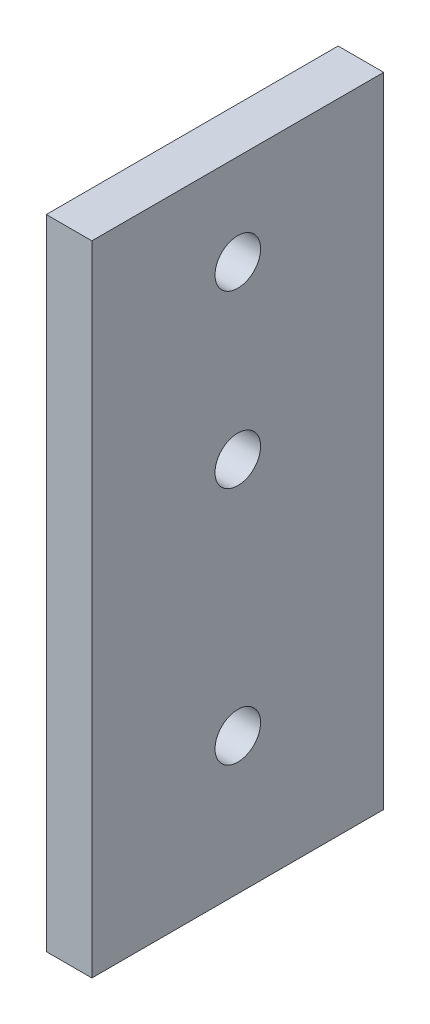
ISO-10303-21;
HEADER;
FILE_DESCRIPTION(('STEP AP214'),'2;1');
FILE_NAME('part.step','',(''),(''),'','','');
FILE_SCHEMA(('AUTOMOTIVE_DESIGN { 1 0 10303 214 1 1 1 1 }'));
ENDSEC;
DATA;
#1=APPLICATION_CONTEXT('core data for automotive mechanical design processes');
#2=APPLICATION_PROTOCOL_DEFINITION('international standard','automotive_design',2000,#1);
#3=PRODUCT_CONTEXT('',#1,'mechanical');
#4=PRODUCT('Part','Part','',(#3));
#5=PRODUCT_RELATED_PRODUCT_CATEGORY('part','',(#4));
#6=PRODUCT_DEFINITION_FORMATION('','',#4);
#7=PRODUCT_DEFINITION_CONTEXT('part definition',#1,'design');
#8=PRODUCT_DEFINITION('design','',#6,#7);
#9=PRODUCT_DEFINITION_SHAPE('','',#8);
#10=(LENGTH_UNIT() NAMED_UNIT(*) SI_UNIT(.MILLI.,.METRE.));
#11=(NAMED_UNIT(*) PLANE_ANGLE_UNIT() SI_UNIT($,.RADIAN.));
#12=(NAMED_UNIT(*) SI_UNIT($,.STERADIAN.) SOLID_ANGLE_UNIT());
#13=UNCERTAINTY_MEASURE_WITH_UNIT(LENGTH_MEASURE(1.E-05),#10,'distance_accuracy_value','');
#14=(GEOMETRIC_REPRESENTATION_CONTEXT(3) GLOBAL_UNCERTAINTY_ASSIGNED_CONTEXT((#13)) GLOBAL_UNIT_ASSIGNED_CONTEXT((#10,
#11,#12)) REPRESENTATION_CONTEXT('',''));
#15=CARTESIAN_POINT('',(0.,0.,0.));
#16=DIRECTION('',(0.,0.,1.));
#17=DIRECTION('',(1.,0.,0.));
#18=AXIS2_PLACEMENT_3D('',#15,#16,#17);
#19=CARTESIAN_POINT('',(6.35,0.,0.));
#20=DIRECTION('',(0.,0.,-1.));
#21=DIRECTION('',(0.,1.,0.));
#22=AXIS2_PLACEMENT_3D('',#19,#20,#21);
#23=PLANE('',#22);
#24=DIRECTION('',(0.,-1.,0.));
#25=VECTOR('',#24,1.);
#26=CARTESIAN_POINT('',(0.,0.,0.));
#27=LINE('',#26,#25);
#28=CARTESIAN_POINT('',(0.,88.9,0.));
#29=VERTEX_POINT('',#28);
#30=CARTESIAN_POINT('',(0.,0.,0.));
#31=VERTEX_POINT('',#30);
#32=EDGE_CURVE('E95',#29,#31,#27,.T.);
#33=ORIENTED_EDGE('',*,*,#32,.T.);
#34=DIRECTION('',(-1.,0.,0.));
#35=VECTOR('',#34,1.);
#36=CARTESIAN_POINT('',(6.35,0.,0.));
#37=LINE('',#36,#35);
#38=CARTESIAN_POINT('',(6.35,0.,0.));
#39=VERTEX_POINT('',#38);
#40=EDGE_CURVE('E11',#39,#31,#37,.T.);
#41=ORIENTED_EDGE('',*,*,#40,.F.);
#42=DIRECTION('',(0.,-1.,0.));
#43=VECTOR('',#42,1.);
#44=CARTESIAN_POINT('',(6.35,0.,0.));
#45=LINE('',#44,#43);
#46=CARTESIAN_POINT('',(6.35,88.9,0.));
#47=VERTEX_POINT('',#46);
#48=EDGE_CURVE('E83',#47,#39,#45,.T.);
#49=ORIENTED_EDGE('',*,*,#48,.F.);
#50=DIRECTION('',(-1.,0.,0.));
#51=VECTOR('',#50,1.);
#52=CARTESIAN_POINT('',(6.35,88.9,0.));
#53=LINE('',#52,#51);
#54=EDGE_CURVE('E91',#47,#29,#53,.T.);
#55=ORIENTED_EDGE('',*,*,#54,.T.);
#56=EDGE_LOOP('',(#33,#41,#49,#55));
#57=FACE_BOUND('',#56,.T.);
#58=ADVANCED_FACE('F32',(#57),#23,.F.);
#59=CARTESIAN_POINT('',(6.35,0.,0.));
#60=DIRECTION('',(0.,1.,0.));
#61=DIRECTION('',(0.,0.,1.));
#62=AXIS2_PLACEMENT_3D('',#59,#60,#61);
#63=PLANE('',#62);
#64=DIRECTION('',(0.,0.,-1.));
#65=VECTOR('',#64,1.);
#66=CARTESIAN_POINT('',(0.,0.,0.));
#67=LINE('',#66,#65);
#68=CARTESIAN_POINT('',(0.,0.,-40.64));
#69=VERTEX_POINT('',#68);
#70=EDGE_CURVE('E87',#31,#69,#67,.T.);
#71=ORIENTED_EDGE('',*,*,#70,.T.);
#72=DIRECTION('',(-1.,0.,0.));
#73=VECTOR('',#72,1.);
#74=CARTESIAN_POINT('',(6.35,0.,-40.64));
#75=LINE('',#74,#73);
#76=CARTESIAN_POINT('',(6.35,0.,-40.64));
#77=VERTEX_POINT('',#76);
#78=EDGE_CURVE('E40',#77,#69,#75,.T.);
#79=ORIENTED_EDGE('',*,*,#78,.F.);
#80=DIRECTION('',(0.,0.,-1.));
#81=VECTOR('',#80,1.);
#82=CARTESIAN_POINT('',(6.35,0.,0.));
#83=LINE('',#82,#81);
#84=EDGE_CURVE('E78',#39,#77,#83,.T.);
#85=ORIENTED_EDGE('',*,*,#84,.F.);
#86=ORIENTED_EDGE('',*,*,#40,.T.);
#87=EDGE_LOOP('',(#71,#79,#85,#86));
#88=FACE_BOUND('',#87,.T.);
#89=ADVANCED_FACE('F86',(#88),#63,.F.);
#90=CARTESIAN_POINT('',(6.35,0.,-40.64));
#91=DIRECTION('',(0.,0.,1.));
#92=DIRECTION('',(0.,-1.,0.));
#93=AXIS2_PLACEMENT_3D('',#90,#91,#92);
#94=PLANE('',#93);
#95=DIRECTION('',(0.,1.,0.));
#96=VECTOR('',#95,1.);
#97=CARTESIAN_POINT('',(0.,0.,-40.64));
#98=LINE('',#97,#96);
#99=CARTESIAN_POINT('',(0.,88.9,-40.64));
#100=VERTEX_POINT('',#99);
#101=EDGE_CURVE('E65',#69,#100,#98,.T.);
#102=ORIENTED_EDGE('',*,*,#101,.T.);
#103=DIRECTION('',(-1.,0.,0.));
#104=VECTOR('',#103,1.);
#105=CARTESIAN_POINT('',(6.35,88.9,-40.64));
#106=LINE('',#105,#104);
#107=CARTESIAN_POINT('',(6.35,88.9,-40.64));
#108=VERTEX_POINT('',#107);
#109=EDGE_CURVE('E88',#108,#100,#106,.T.);
#110=ORIENTED_EDGE('',*,*,#109,.F.);
#111=DIRECTION('',(0.,1.,0.));
#112=VECTOR('',#111,1.);
#113=CARTESIAN_POINT('',(6.35,0.,-40.64));
#114=LINE('',#113,#112);
#115=EDGE_CURVE('E81',#77,#108,#114,.T.);
#116=ORIENTED_EDGE('',*,*,#115,.F.);
#117=ORIENTED_EDGE('',*,*,#78,.T.);
#118=EDGE_LOOP('',(#102,#110,#116,#117));
#119=FACE_BOUND('',#118,.T.);
#120=ADVANCED_FACE('F89',(#119),#94,.F.);
#121=CARTESIAN_POINT('',(6.35,88.9,0.));
#122=DIRECTION('',(0.,-1.,0.));
#123=DIRECTION('',(0.,0.,-1.));
#124=AXIS2_PLACEMENT_3D('',#121,#122,#123);
#125=PLANE('',#124);
#126=DIRECTION('',(0.,0.,1.));
#127=VECTOR('',#126,1.);
#128=CARTESIAN_POINT('',(0.,88.9,0.));
#129=LINE('',#128,#127);
#130=EDGE_CURVE('E71',#100,#29,#129,.T.);
#131=ORIENTED_EDGE('',*,*,#130,.T.);
#132=ORIENTED_EDGE('',*,*,#54,.F.);
#133=DIRECTION('',(0.,0.,1.));
#134=VECTOR('',#133,1.);
#135=CARTESIAN_POINT('',(6.35,88.9,0.));
#136=LINE('',#135,#134);
#137=EDGE_CURVE('E48',#108,#47,#136,.T.);
#138=ORIENTED_EDGE('',*,*,#137,.F.);
#139=ORIENTED_EDGE('',*,*,#109,.T.);
#140=EDGE_LOOP('',(#131,#132,#138,#139));
#141=FACE_BOUND('',#140,.T.);
#142=ADVANCED_FACE('F103',(#141),#125,.F.);
#143=CARTESIAN_POINT('',(6.35,0.,0.));
#144=DIRECTION('',(-1.,0.,0.));
#145=DIRECTION('',(0.,0.,1.));
#146=AXIS2_PLACEMENT_3D('',#143,#144,#145);
#147=PLANE('',#146);
#148=CARTESIAN_POINT('',(6.35,76.2,-20.32));
#149=DIRECTION('',(1.,0.,0.));
#150=DIRECTION('',(0.,0.,-1.));
#151=AXIS2_PLACEMENT_3D('',#148,#149,#150);
#152=CIRCLE('',#151,3.175);
#153=CARTESIAN_POINT('',(6.35,76.2,-23.495));
#154=VERTEX_POINT('',#153);
#155=EDGE_CURVE('E121',#154,#154,#152,.T.);
#156=ORIENTED_EDGE('',*,*,#155,.F.);
#157=EDGE_LOOP('',(#156));
#158=FACE_BOUND('',#157,.T.);
#159=CARTESIAN_POINT('',(6.35,52.3875,-20.32));
#160=DIRECTION('',(1.,0.,0.));
#161=DIRECTION('',(0.,0.,-1.));
#162=AXIS2_PLACEMENT_3D('',#159,#160,#161);
#163=CIRCLE('',#162,3.175);
#164=CARTESIAN_POINT('',(6.35,52.3875,-23.495));
#165=VERTEX_POINT('',#164);
#166=EDGE_CURVE('E115',#165,#165,#163,.T.);
#167=ORIENTED_EDGE('',*,*,#166,.F.);
#168=EDGE_LOOP('',(#167));
#169=FACE_BOUND('',#168,.T.);
#170=CARTESIAN_POINT('',(6.35,19.05,-20.32));
#171=DIRECTION('',(1.,0.,0.));
#172=DIRECTION('',(0.,0.,-1.));
#173=AXIS2_PLACEMENT_3D('',#170,#171,#172);
#174=CIRCLE('',#173,3.175);
#175=CARTESIAN_POINT('',(6.35,19.05,-23.495));
#176=VERTEX_POINT('',#175);
#177=EDGE_CURVE('E109',#176,#176,#174,.T.);
#178=ORIENTED_EDGE('',*,*,#177,.F.);
#179=EDGE_LOOP('',(#178));
#180=FACE_BOUND('',#179,.T.);
#181=ORIENTED_EDGE('',*,*,#48,.T.);
#182=ORIENTED_EDGE('',*,*,#84,.T.);
#183=ORIENTED_EDGE('',*,*,#115,.T.);
#184=ORIENTED_EDGE('',*,*,#137,.T.);
#185=EDGE_LOOP('',(#181,#182,#183,#184));
#186=FACE_BOUND('',#185,.T.);
#187=ADVANCED_FACE('F79',(#158,#169,#180,#186),#147,.F.);
#188=CARTESIAN_POINT('',(0.,0.,0.));
#189=DIRECTION('',(-1.,0.,0.));
#190=DIRECTION('',(0.,0.,1.));
#191=AXIS2_PLACEMENT_3D('',#188,#189,#190);
#192=PLANE('',#191);
#193=CARTESIAN_POINT('',(0.,76.2,-20.32));
#194=DIRECTION('',(1.,0.,0.));
#195=DIRECTION('',(0.,0.,-1.));
#196=AXIS2_PLACEMENT_3D('',#193,#194,#195);
#197=CIRCLE('',#196,3.175);
#198=CARTESIAN_POINT('',(0.,76.2,-23.495));
#199=VERTEX_POINT('',#198);
#200=EDGE_CURVE('E118',#199,#199,#197,.T.);
#201=ORIENTED_EDGE('',*,*,#200,.T.);
#202=EDGE_LOOP('',(#201));
#203=FACE_BOUND('',#202,.T.);
#204=CARTESIAN_POINT('',(0.,52.3875,-20.32));
#205=DIRECTION('',(1.,0.,0.));
#206=DIRECTION('',(0.,0.,-1.));
#207=AXIS2_PLACEMENT_3D('',#204,#205,#206);
#208=CIRCLE('',#207,3.175);
#209=CARTESIAN_POINT('',(0.,52.3875,-23.495));
#210=VERTEX_POINT('',#209);
#211=EDGE_CURVE('E112',#210,#210,#208,.T.);
#212=ORIENTED_EDGE('',*,*,#211,.T.);
#213=EDGE_LOOP('',(#212));
#214=FACE_BOUND('',#213,.T.);
#215=CARTESIAN_POINT('',(0.,19.05,-20.32));
#216=DIRECTION('',(1.,0.,0.));
#217=DIRECTION('',(0.,0.,-1.));
#218=AXIS2_PLACEMENT_3D('',#215,#216,#217);
#219=CIRCLE('',#218,3.175);
#220=CARTESIAN_POINT('',(0.,19.05,-23.495));
#221=VERTEX_POINT('',#220);
#222=EDGE_CURVE('E98',#221,#221,#219,.T.);
#223=ORIENTED_EDGE('',*,*,#222,.T.);
#224=EDGE_LOOP('',(#223));
#225=FACE_BOUND('',#224,.T.);
#226=ORIENTED_EDGE('',*,*,#32,.F.);
#227=ORIENTED_EDGE('',*,*,#130,.F.);
#228=ORIENTED_EDGE('',*,*,#101,.F.);
#229=ORIENTED_EDGE('',*,*,#70,.F.);
#230=EDGE_LOOP('',(#226,#227,#228,#229));
#231=FACE_BOUND('',#230,.T.);
#232=ADVANCED_FACE('F106',(#203,#214,#225,#231),#192,.T.);
#233=CARTESIAN_POINT('',(0.,19.05,-20.32));
#234=DIRECTION('',(1.,0.,0.));
#235=DIRECTION('',(0.,0.,-1.));
#236=AXIS2_PLACEMENT_3D('',#233,#234,#235);
#237=CYLINDRICAL_SURFACE('',#236,3.175);
#238=ORIENTED_EDGE('',*,*,#222,.F.);
#239=EDGE_LOOP('',(#238));
#240=FACE_BOUND('',#239,.T.);
#241=ORIENTED_EDGE('',*,*,#177,.T.);
#242=EDGE_LOOP('',(#241));
#243=FACE_BOUND('',#242,.T.);
#244=ADVANCED_FACE('F143',(#240,#243),#237,.F.);
#245=CARTESIAN_POINT('',(0.,52.3875,-20.32));
#246=DIRECTION('',(1.,0.,0.));
#247=DIRECTION('',(0.,0.,-1.));
#248=AXIS2_PLACEMENT_3D('',#245,#246,#247);
#249=CYLINDRICAL_SURFACE('',#248,3.175);
#250=ORIENTED_EDGE('',*,*,#211,.F.);
#251=EDGE_LOOP('',(#250));
#252=FACE_BOUND('',#251,.T.);
#253=ORIENTED_EDGE('',*,*,#166,.T.);
#254=EDGE_LOOP('',(#253));
#255=FACE_BOUND('',#254,.T.);
#256=ADVANCED_FACE('F132',(#252,#255),#249,.F.);
#257=CARTESIAN_POINT('',(0.,76.2,-20.32));
#258=DIRECTION('',(1.,0.,0.));
#259=DIRECTION('',(0.,0.,-1.));
#260=AXIS2_PLACEMENT_3D('',#257,#258,#259);
#261=CYLINDRICAL_SURFACE('',#260,3.175);
#262=ORIENTED_EDGE('',*,*,#200,.F.);
#263=EDGE_LOOP('',(#262));
#264=FACE_BOUND('',#263,.T.);
#265=ORIENTED_EDGE('',*,*,#155,.T.);
#266=EDGE_LOOP('',(#265));
#267=FACE_BOUND('',#266,.T.);
#268=ADVANCED_FACE('F129',(#264,#267),#261,.F.);
#269=CLOSED_SHELL('',(#58,#89,#120,#142,#187,#232,#244,#256,#268));
#270=MANIFOLD_SOLID_BREP('B2',#269);
#271=ADVANCED_BREP_SHAPE_REPRESENTATION('',(#18,#270),#14);
#272=SHAPE_DEFINITION_REPRESENTATION(#9,#271);
ENDSEC;
END-ISO-10303-21;
